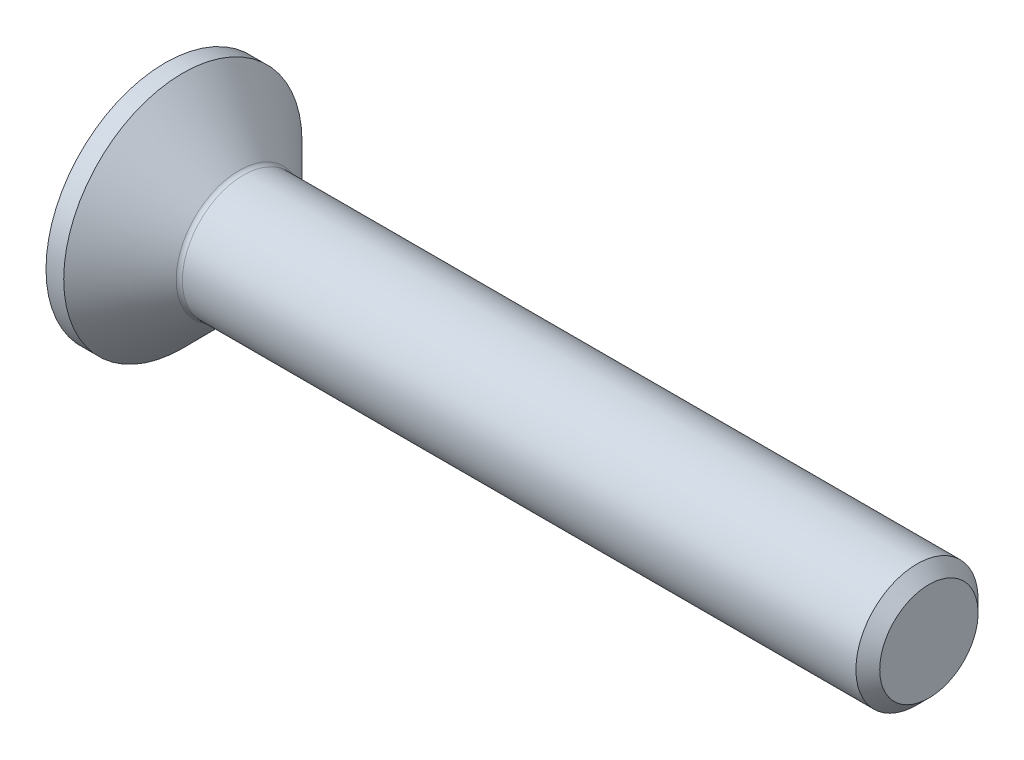
ISO-10303-21;
HEADER;
FILE_DESCRIPTION(('STEP AP214'),'2;1');
FILE_NAME('part.step','',(''),(''),'','','');
FILE_SCHEMA(('AUTOMOTIVE_DESIGN { 1 0 10303 214 1 1 1 1 }'));
ENDSEC;
DATA;
#1=APPLICATION_CONTEXT('core data for automotive mechanical design processes');
#2=APPLICATION_PROTOCOL_DEFINITION('international standard','automotive_design',2000,#1);
#3=PRODUCT_CONTEXT('',#1,'mechanical');
#4=PRODUCT('Part','Part','',(#3));
#5=PRODUCT_RELATED_PRODUCT_CATEGORY('part','',(#4));
#6=PRODUCT_DEFINITION_FORMATION('','',#4);
#7=PRODUCT_DEFINITION_CONTEXT('part definition',#1,'design');
#8=PRODUCT_DEFINITION('design','',#6,#7);
#9=PRODUCT_DEFINITION_SHAPE('','',#8);
#10=(LENGTH_UNIT() NAMED_UNIT(*) SI_UNIT(.MILLI.,.METRE.));
#11=(NAMED_UNIT(*) PLANE_ANGLE_UNIT() SI_UNIT($,.RADIAN.));
#12=(NAMED_UNIT(*) SI_UNIT($,.STERADIAN.) SOLID_ANGLE_UNIT());
#13=UNCERTAINTY_MEASURE_WITH_UNIT(LENGTH_MEASURE(1.E-05),#10,'distance_accuracy_value','');
#14=(GEOMETRIC_REPRESENTATION_CONTEXT(3) GLOBAL_UNCERTAINTY_ASSIGNED_CONTEXT((#13)) GLOBAL_UNIT_ASSIGNED_CONTEXT((#10,
#11,#12)) REPRESENTATION_CONTEXT('',''));
#15=CARTESIAN_POINT('',(0.,0.,0.));
#16=DIRECTION('',(0.,0.,1.));
#17=DIRECTION('',(1.,0.,0.));
#18=AXIS2_PLACEMENT_3D('',#15,#16,#17);
#19=CARTESIAN_POINT('',(0.,0.,0.));
#20=DIRECTION('',(-1.,0.,0.));
#21=DIRECTION('',(0.,0.,1.));
#22=AXIS2_PLACEMENT_3D('',#19,#20,#21);
#23=PLANE('',#22);
#24=CARTESIAN_POINT('',(0.,0.,0.));
#25=DIRECTION('',(-1.,0.,0.));
#26=DIRECTION('',(0.,0.,1.));
#27=AXIS2_PLACEMENT_3D('',#24,#25,#26);
#28=CIRCLE('',#27,3.9);
#29=CARTESIAN_POINT('',(0.,0.,3.9));
#30=VERTEX_POINT('',#29);
#31=EDGE_CURVE('E198',#30,#30,#28,.T.);
#32=ORIENTED_EDGE('',*,*,#31,.T.);
#33=EDGE_LOOP('',(#32));
#34=FACE_BOUND('',#33,.T.);
#35=DIRECTION('',(0.,-0.5,-0.866025403784438));
#36=VECTOR('',#35,1.);
#37=CARTESIAN_POINT('',(0.,-0.721687836487032,1.25));
#38=LINE('',#37,#36);
#39=CARTESIAN_POINT('',(0.,-0.721687836487032,1.25));
#40=VERTEX_POINT('',#39);
#41=CARTESIAN_POINT('',(0.,-1.44337567297407,0.));
#42=VERTEX_POINT('',#41);
#43=EDGE_CURVE('E151',#40,#42,#38,.T.);
#44=ORIENTED_EDGE('',*,*,#43,.T.);
#45=DIRECTION('',(0.,0.5,-0.866025403784438));
#46=VECTOR('',#45,1.);
#47=CARTESIAN_POINT('',(0.,-1.44337567297407,0.));
#48=LINE('',#47,#46);
#49=CARTESIAN_POINT('',(0.,-0.721687836487032,-1.25));
#50=VERTEX_POINT('',#49);
#51=EDGE_CURVE('E63',#42,#50,#48,.T.);
#52=ORIENTED_EDGE('',*,*,#51,.T.);
#53=DIRECTION('',(0.,1.,0.));
#54=VECTOR('',#53,1.);
#55=CARTESIAN_POINT('',(0.,-0.721687836487032,-1.25));
#56=LINE('',#55,#54);
#57=CARTESIAN_POINT('',(0.,0.721687836487032,-1.25));
#58=VERTEX_POINT('',#57);
#59=EDGE_CURVE('E167',#50,#58,#56,.T.);
#60=ORIENTED_EDGE('',*,*,#59,.T.);
#61=DIRECTION('',(0.,0.5,0.866025403784438));
#62=VECTOR('',#61,1.);
#63=CARTESIAN_POINT('',(0.,0.721687836487032,-1.25));
#64=LINE('',#63,#62);
#65=CARTESIAN_POINT('',(0.,1.44337567297406,0.));
#66=VERTEX_POINT('',#65);
#67=EDGE_CURVE('E328',#58,#66,#64,.T.);
#68=ORIENTED_EDGE('',*,*,#67,.T.);
#69=DIRECTION('',(0.,-0.5,0.866025403784439));
#70=VECTOR('',#69,1.);
#71=CARTESIAN_POINT('',(0.,1.44337567297406,0.));
#72=LINE('',#71,#70);
#73=CARTESIAN_POINT('',(0.,0.721687836487032,1.25));
#74=VERTEX_POINT('',#73);
#75=EDGE_CURVE('E332',#66,#74,#72,.T.);
#76=ORIENTED_EDGE('',*,*,#75,.T.);
#77=DIRECTION('',(0.,-1.,0.));
#78=VECTOR('',#77,1.);
#79=CARTESIAN_POINT('',(0.,0.721687836487032,1.25));
#80=LINE('',#79,#78);
#81=EDGE_CURVE('E336',#74,#40,#80,.T.);
#82=ORIENTED_EDGE('',*,*,#81,.T.);
#83=EDGE_LOOP('',(#44,#52,#60,#68,#76,#82));
#84=FACE_BOUND('',#83,.T.);
#85=ADVANCED_FACE('F45',(#34,#84),#23,.T.);
#86=CARTESIAN_POINT('',(0.,0.,0.));
#87=DIRECTION('',(-1.,0.,0.));
#88=DIRECTION('',(0.,0.,1.));
#89=AXIS2_PLACEMENT_3D('',#86,#87,#88);
#90=CYLINDRICAL_SURFACE('',#89,3.9);
#91=CARTESIAN_POINT('',(0.580000000000009,0.,0.));
#92=DIRECTION('',(-1.,0.,0.));
#93=DIRECTION('',(0.,0.,1.));
#94=AXIS2_PLACEMENT_3D('',#91,#92,#93);
#95=CIRCLE('',#94,3.9);
#96=CARTESIAN_POINT('',(0.580000000000009,0.,3.9));
#97=VERTEX_POINT('',#96);
#98=EDGE_CURVE('E194',#97,#97,#95,.T.);
#99=ORIENTED_EDGE('',*,*,#98,.T.);
#100=EDGE_LOOP('',(#99));
#101=FACE_BOUND('',#100,.T.);
#102=ORIENTED_EDGE('',*,*,#31,.F.);
#103=EDGE_LOOP('',(#102));
#104=FACE_BOUND('',#103,.T.);
#105=ADVANCED_FACE('F222',(#101,#104),#90,.T.);
#106=CARTESIAN_POINT('',(0.580000000000009,0.,0.));
#107=DIRECTION('',(-1.,0.,0.));
#108=DIRECTION('',(0.,0.,1.));
#109=AXIS2_PLACEMENT_3D('',#106,#107,#108);
#110=CONICAL_SURFACE('',#109,3.9,0.78539816339745);
#111=CARTESIAN_POINT('',(2.42142135623732,0.,0.));
#112=DIRECTION('',(-1.,0.,0.));
#113=DIRECTION('',(0.,0.,1.));
#114=AXIS2_PLACEMENT_3D('',#111,#112,#113);
#115=CIRCLE('',#114,2.05857864376268);
#116=CARTESIAN_POINT('',(2.42142135623732,0.,2.05857864376268));
#117=VERTEX_POINT('',#116);
#118=EDGE_CURVE('E54',#117,#117,#115,.T.);
#119=ORIENTED_EDGE('',*,*,#118,.T.);
#120=EDGE_LOOP('',(#119));
#121=FACE_BOUND('',#120,.T.);
#122=ORIENTED_EDGE('',*,*,#98,.F.);
#123=EDGE_LOOP('',(#122));
#124=FACE_BOUND('',#123,.T.);
#125=ADVANCED_FACE('F206',(#121,#124),#110,.T.);
#126=CARTESIAN_POINT('',(0.,0.,0.));
#127=DIRECTION('',(-1.,0.,0.));
#128=DIRECTION('',(0.,0.,1.));
#129=AXIS2_PLACEMENT_3D('',#126,#127,#128);
#130=CYLINDRICAL_SURFACE('',#129,1.99999999999999);
#131=CARTESIAN_POINT('',(2.56284271247463,0.,0.));
#132=DIRECTION('',(-1.,0.,0.));
#133=DIRECTION('',(0.,0.,1.));
#134=AXIS2_PLACEMENT_3D('',#131,#132,#133);
#135=CIRCLE('',#134,1.99999999999999);
#136=CARTESIAN_POINT('',(2.56284271247463,0.,1.99999999999999));
#137=VERTEX_POINT('',#136);
#138=EDGE_CURVE('E11',#137,#137,#135,.F.);
#139=ORIENTED_EDGE('',*,*,#138,.T.);
#140=EDGE_LOOP('',(#139));
#141=FACE_BOUND('',#140,.T.);
#142=CARTESIAN_POINT('',(24.61,0.,0.));
#143=DIRECTION('',(-1.,0.,0.));
#144=DIRECTION('',(0.,0.,1.));
#145=AXIS2_PLACEMENT_3D('',#142,#143,#144);
#146=CIRCLE('',#145,1.99999999999997);
#147=CARTESIAN_POINT('',(24.61,0.,1.99999999999997));
#148=VERTEX_POINT('',#147);
#149=EDGE_CURVE('E190',#148,#148,#146,.T.);
#150=ORIENTED_EDGE('',*,*,#149,.T.);
#151=EDGE_LOOP('',(#150));
#152=FACE_BOUND('',#151,.T.);
#153=ADVANCED_FACE('F233',(#141,#152),#130,.T.);
#154=CARTESIAN_POINT('',(25.,0.,0.));
#155=DIRECTION('',(-1.,0.,0.));
#156=DIRECTION('',(0.,0.,1.));
#157=AXIS2_PLACEMENT_3D('',#154,#155,#156);
#158=CONICAL_SURFACE('',#157,1.61,0.785398163397393);
#159=ORIENTED_EDGE('',*,*,#149,.F.);
#160=EDGE_LOOP('',(#159));
#161=FACE_BOUND('',#160,.T.);
#162=CARTESIAN_POINT('',(25.,0.,0.));
#163=DIRECTION('',(-1.,0.,0.));
#164=DIRECTION('',(0.,0.,1.));
#165=AXIS2_PLACEMENT_3D('',#162,#163,#164);
#166=CIRCLE('',#165,1.61);
#167=CARTESIAN_POINT('',(25.,0.,1.61));
#168=VERTEX_POINT('',#167);
#169=EDGE_CURVE('E185',#168,#168,#166,.T.);
#170=ORIENTED_EDGE('',*,*,#169,.T.);
#171=EDGE_LOOP('',(#170));
#172=FACE_BOUND('',#171,.T.);
#173=ADVANCED_FACE('F217',(#161,#172),#158,.T.);
#174=CARTESIAN_POINT('',(25.,1.61,0.));
#175=DIRECTION('',(1.,0.,0.));
#176=DIRECTION('',(0.,0.,-1.));
#177=AXIS2_PLACEMENT_3D('',#174,#175,#176);
#178=PLANE('',#177);
#179=ORIENTED_EDGE('',*,*,#169,.F.);
#180=EDGE_LOOP('',(#179));
#181=FACE_BOUND('',#180,.T.);
#182=ADVANCED_FACE('F210',(#181),#178,.T.);
#183=CARTESIAN_POINT('',(2.56284271247463,0.,0.));
#184=DIRECTION('',(-1.,0.,0.));
#185=DIRECTION('',(0.,0.,1.));
#186=AXIS2_PLACEMENT_3D('',#183,#184,#185);
#187=TOROIDAL_SURFACE('',#186,2.19999999999999,0.2);
#188=ORIENTED_EDGE('',*,*,#138,.F.);
#189=EDGE_LOOP('',(#188));
#190=FACE_BOUND('',#189,.T.);
#191=ORIENTED_EDGE('',*,*,#118,.F.);
#192=EDGE_LOOP('',(#191));
#193=FACE_BOUND('',#192,.T.);
#194=ADVANCED_FACE('F47',(#190,#193),#187,.F.);
#195=CARTESIAN_POINT('',(1.5,-1.44337567297407,0.));
#196=DIRECTION('',(0.,0.866025403784438,0.5));
#197=DIRECTION('',(0.,-0.5,0.866025403784439));
#198=AXIS2_PLACEMENT_3D('',#195,#196,#197);
#199=PLANE('',#198);
#200=ORIENTED_EDGE('',*,*,#51,.F.);
#201=DIRECTION('',(-1.,0.,0.));
#202=VECTOR('',#201,1.);
#203=CARTESIAN_POINT('',(1.5,-1.44337567297407,0.));
#204=LINE('',#203,#202);
#205=CARTESIAN_POINT('',(1.5,-1.44337567297407,0.));
#206=VERTEX_POINT('',#205);
#207=EDGE_CURVE('E323',#206,#42,#204,.T.);
#208=ORIENTED_EDGE('',*,*,#207,.F.);
#209=DIRECTION('',(0.,0.5,-0.866025403784438));
#210=VECTOR('',#209,1.);
#211=CARTESIAN_POINT('',(1.5,-1.44337567297407,0.));
#212=LINE('',#211,#210);
#213=CARTESIAN_POINT('',(1.5,-1.08253175473055,-0.625000000000001));
#214=VERTEX_POINT('',#213);
#215=EDGE_CURVE('E147',#206,#214,#212,.T.);
#216=ORIENTED_EDGE('',*,*,#215,.T.);
#217=CARTESIAN_POINT('',(1.5,-0.721687836487032,-1.25));
#218=VERTEX_POINT('',#217);
#219=EDGE_CURVE('E141',#214,#218,#212,.T.);
#220=ORIENTED_EDGE('',*,*,#219,.T.);
#221=DIRECTION('',(-1.,0.,0.));
#222=VECTOR('',#221,1.);
#223=CARTESIAN_POINT('',(1.5,-0.721687836487032,-1.25));
#224=LINE('',#223,#222);
#225=EDGE_CURVE('E145',#218,#50,#224,.T.);
#226=ORIENTED_EDGE('',*,*,#225,.T.);
#227=EDGE_LOOP('',(#200,#208,#216,#220,#226));
#228=FACE_BOUND('',#227,.T.);
#229=ADVANCED_FACE('F143',(#228),#199,.T.);
#230=CARTESIAN_POINT('',(1.5,-0.721687836487032,-1.25));
#231=DIRECTION('',(0.,0.,1.));
#232=DIRECTION('',(0.,-1.,0.));
#233=AXIS2_PLACEMENT_3D('',#230,#231,#232);
#234=PLANE('',#233);
#235=ORIENTED_EDGE('',*,*,#59,.F.);
#236=ORIENTED_EDGE('',*,*,#225,.F.);
#237=DIRECTION('',(0.,1.,0.));
#238=VECTOR('',#237,1.);
#239=CARTESIAN_POINT('',(1.5,-0.721687836487032,-1.25));
#240=LINE('',#239,#238);
#241=CARTESIAN_POINT('',(1.5,0.,-1.25));
#242=VERTEX_POINT('',#241);
#243=EDGE_CURVE('E154',#218,#242,#240,.T.);
#244=ORIENTED_EDGE('',*,*,#243,.T.);
#245=CARTESIAN_POINT('',(1.5,0.721687836487032,-1.25));
#246=VERTEX_POINT('',#245);
#247=EDGE_CURVE('E162',#242,#246,#240,.T.);
#248=ORIENTED_EDGE('',*,*,#247,.T.);
#249=DIRECTION('',(-1.,0.,0.));
#250=VECTOR('',#249,1.);
#251=CARTESIAN_POINT('',(1.5,0.721687836487032,-1.25));
#252=LINE('',#251,#250);
#253=EDGE_CURVE('E170',#246,#58,#252,.T.);
#254=ORIENTED_EDGE('',*,*,#253,.T.);
#255=EDGE_LOOP('',(#235,#236,#244,#248,#254));
#256=FACE_BOUND('',#255,.T.);
#257=ADVANCED_FACE('F164',(#256),#234,.T.);
#258=CARTESIAN_POINT('',(1.5,0.721687836487032,-1.25));
#259=DIRECTION('',(0.,-0.866025403784439,0.5));
#260=DIRECTION('',(0.,-0.5,-0.866025403784439));
#261=AXIS2_PLACEMENT_3D('',#258,#259,#260);
#262=PLANE('',#261);
#263=ORIENTED_EDGE('',*,*,#67,.F.);
#264=ORIENTED_EDGE('',*,*,#253,.F.);
#265=DIRECTION('',(0.,0.5,0.866025403784438));
#266=VECTOR('',#265,1.);
#267=CARTESIAN_POINT('',(1.5,0.721687836487032,-1.25));
#268=LINE('',#267,#266);
#269=CARTESIAN_POINT('',(1.5,1.08253175473055,-0.625));
#270=VERTEX_POINT('',#269);
#271=EDGE_CURVE('E311',#246,#270,#268,.T.);
#272=ORIENTED_EDGE('',*,*,#271,.T.);
#273=CARTESIAN_POINT('',(1.5,1.44337567297406,0.));
#274=VERTEX_POINT('',#273);
#275=EDGE_CURVE('E161',#270,#274,#268,.T.);
#276=ORIENTED_EDGE('',*,*,#275,.T.);
#277=DIRECTION('',(-1.,0.,0.));
#278=VECTOR('',#277,1.);
#279=CARTESIAN_POINT('',(1.5,1.44337567297406,0.));
#280=LINE('',#279,#278);
#281=EDGE_CURVE('E179',#274,#66,#280,.T.);
#282=ORIENTED_EDGE('',*,*,#281,.T.);
#283=EDGE_LOOP('',(#263,#264,#272,#276,#282));
#284=FACE_BOUND('',#283,.T.);
#285=ADVANCED_FACE('F247',(#284),#262,.T.);
#286=CARTESIAN_POINT('',(1.5,1.44337567297406,0.));
#287=DIRECTION('',(0.,-0.866025403784438,-0.5));
#288=DIRECTION('',(0.,0.5,-0.866025403784439));
#289=AXIS2_PLACEMENT_3D('',#286,#287,#288);
#290=PLANE('',#289);
#291=ORIENTED_EDGE('',*,*,#75,.F.);
#292=ORIENTED_EDGE('',*,*,#281,.F.);
#293=DIRECTION('',(0.,-0.5,0.866025403784439));
#294=VECTOR('',#293,1.);
#295=CARTESIAN_POINT('',(1.5,1.44337567297406,0.));
#296=LINE('',#295,#294);
#297=CARTESIAN_POINT('',(1.5,1.08253175473055,0.625));
#298=VERTEX_POINT('',#297);
#299=EDGE_CURVE('E74',#274,#298,#296,.T.);
#300=ORIENTED_EDGE('',*,*,#299,.T.);
#301=CARTESIAN_POINT('',(1.5,0.721687836487032,1.25));
#302=VERTEX_POINT('',#301);
#303=EDGE_CURVE('E282',#298,#302,#296,.T.);
#304=ORIENTED_EDGE('',*,*,#303,.T.);
#305=DIRECTION('',(-1.,0.,0.));
#306=VECTOR('',#305,1.);
#307=CARTESIAN_POINT('',(1.5,0.721687836487032,1.25));
#308=LINE('',#307,#306);
#309=EDGE_CURVE('E297',#302,#74,#308,.T.);
#310=ORIENTED_EDGE('',*,*,#309,.T.);
#311=EDGE_LOOP('',(#291,#292,#300,#304,#310));
#312=FACE_BOUND('',#311,.T.);
#313=ADVANCED_FACE('F250',(#312),#290,.T.);
#314=CARTESIAN_POINT('',(1.5,0.721687836487032,1.25));
#315=DIRECTION('',(0.,0.,-1.));
#316=DIRECTION('',(-1.,0.,0.));
#317=AXIS2_PLACEMENT_3D('',#314,#315,#316);
#318=PLANE('',#317);
#319=ORIENTED_EDGE('',*,*,#81,.F.);
#320=ORIENTED_EDGE('',*,*,#309,.F.);
#321=DIRECTION('',(0.,-1.,0.));
#322=VECTOR('',#321,1.);
#323=CARTESIAN_POINT('',(1.5,0.721687836487032,1.25));
#324=LINE('',#323,#322);
#325=CARTESIAN_POINT('',(1.5,0.,1.25));
#326=VERTEX_POINT('',#325);
#327=EDGE_CURVE('E281',#302,#326,#324,.T.);
#328=ORIENTED_EDGE('',*,*,#327,.T.);
#329=CARTESIAN_POINT('',(1.5,-0.721687836487032,1.25));
#330=VERTEX_POINT('',#329);
#331=EDGE_CURVE('E287',#326,#330,#324,.T.);
#332=ORIENTED_EDGE('',*,*,#331,.T.);
#333=DIRECTION('',(-1.,0.,0.));
#334=VECTOR('',#333,1.);
#335=CARTESIAN_POINT('',(1.5,-0.721687836487032,1.25));
#336=LINE('',#335,#334);
#337=EDGE_CURVE('E345',#330,#40,#336,.T.);
#338=ORIENTED_EDGE('',*,*,#337,.T.);
#339=EDGE_LOOP('',(#319,#320,#328,#332,#338));
#340=FACE_BOUND('',#339,.T.);
#341=ADVANCED_FACE('F254',(#340),#318,.T.);
#342=CARTESIAN_POINT('',(1.5,-0.721687836487032,1.25));
#343=DIRECTION('',(0.,0.866025403784438,-0.5));
#344=DIRECTION('',(0.,0.5,0.866025403784439));
#345=AXIS2_PLACEMENT_3D('',#342,#343,#344);
#346=PLANE('',#345);
#347=ORIENTED_EDGE('',*,*,#43,.F.);
#348=ORIENTED_EDGE('',*,*,#337,.F.);
#349=DIRECTION('',(0.,-0.5,-0.866025403784438));
#350=VECTOR('',#349,1.);
#351=CARTESIAN_POINT('',(1.5,-0.721687836487032,1.25));
#352=LINE('',#351,#350);
#353=CARTESIAN_POINT('',(1.5,-1.08253175473055,0.625000000000001));
#354=VERTEX_POINT('',#353);
#355=EDGE_CURVE('E290',#330,#354,#352,.T.);
#356=ORIENTED_EDGE('',*,*,#355,.T.);
#357=EDGE_CURVE('E299',#354,#206,#352,.T.);
#358=ORIENTED_EDGE('',*,*,#357,.T.);
#359=ORIENTED_EDGE('',*,*,#207,.T.);
#360=EDGE_LOOP('',(#347,#348,#356,#358,#359));
#361=FACE_BOUND('',#360,.T.);
#362=ADVANCED_FACE('F257',(#361),#346,.T.);
#363=CARTESIAN_POINT('',(1.5,-1.44337567297407,0.));
#364=DIRECTION('',(-1.,0.,0.));
#365=DIRECTION('',(0.,0.,1.));
#366=AXIS2_PLACEMENT_3D('',#363,#364,#365);
#367=PLANE('',#366);
#368=CARTESIAN_POINT('',(1.5,0.,0.));
#369=DIRECTION('',(-1.,0.,0.));
#370=DIRECTION('',(0.,0.,1.));
#371=AXIS2_PLACEMENT_3D('',#368,#369,#370);
#372=CIRCLE('',#371,1.25);
#373=EDGE_CURVE('E169',#354,#326,#372,.T.);
#374=ORIENTED_EDGE('',*,*,#373,.F.);
#375=ORIENTED_EDGE('',*,*,#355,.F.);
#376=ORIENTED_EDGE('',*,*,#331,.F.);
#377=EDGE_LOOP('',(#374,#375,#376));
#378=FACE_BOUND('',#377,.T.);
#379=ADVANCED_FACE('F261',(#378),#367,.T.);
#380=EDGE_CURVE('E175',#214,#354,#372,.T.);
#381=ORIENTED_EDGE('',*,*,#380,.F.);
#382=ORIENTED_EDGE('',*,*,#215,.F.);
#383=ORIENTED_EDGE('',*,*,#357,.F.);
#384=EDGE_LOOP('',(#381,#382,#383));
#385=FACE_BOUND('',#384,.T.);
#386=ADVANCED_FACE('F264',(#385),#367,.T.);
#387=EDGE_CURVE('E156',#242,#214,#372,.T.);
#388=ORIENTED_EDGE('',*,*,#387,.F.);
#389=ORIENTED_EDGE('',*,*,#243,.F.);
#390=ORIENTED_EDGE('',*,*,#219,.F.);
#391=EDGE_LOOP('',(#388,#389,#390));
#392=FACE_BOUND('',#391,.T.);
#393=ADVANCED_FACE('F155',(#392),#367,.T.);
#394=EDGE_CURVE('E305',#270,#242,#372,.T.);
#395=ORIENTED_EDGE('',*,*,#394,.F.);
#396=ORIENTED_EDGE('',*,*,#271,.F.);
#397=ORIENTED_EDGE('',*,*,#247,.F.);
#398=EDGE_LOOP('',(#395,#396,#397));
#399=FACE_BOUND('',#398,.T.);
#400=ADVANCED_FACE('F276',(#399),#367,.T.);
#401=EDGE_CURVE('E186',#298,#270,#372,.T.);
#402=ORIENTED_EDGE('',*,*,#401,.F.);
#403=ORIENTED_EDGE('',*,*,#299,.F.);
#404=ORIENTED_EDGE('',*,*,#275,.F.);
#405=EDGE_LOOP('',(#402,#403,#404));
#406=FACE_BOUND('',#405,.T.);
#407=ADVANCED_FACE('F271',(#406),#367,.T.);
#408=EDGE_CURVE('E177',#326,#298,#372,.T.);
#409=ORIENTED_EDGE('',*,*,#408,.F.);
#410=ORIENTED_EDGE('',*,*,#327,.F.);
#411=ORIENTED_EDGE('',*,*,#303,.F.);
#412=EDGE_LOOP('',(#409,#410,#411));
#413=FACE_BOUND('',#412,.T.);
#414=ADVANCED_FACE('F242',(#413),#367,.T.);
#415=CARTESIAN_POINT('',(1.5,0.,0.));
#416=DIRECTION('',(-1.,0.,0.));
#417=DIRECTION('',(0.,0.,1.));
#418=AXIS2_PLACEMENT_3D('',#415,#416,#417);
#419=CONICAL_SURFACE('',#418,1.25,1.04719755119659);
#420=CARTESIAN_POINT('',(2.22168783648704,0.,0.));
#421=VERTEX_POINT('',#420);
#422=VERTEX_LOOP('',#421);
#423=FACE_BOUND('',#422,.T.);
#424=ORIENTED_EDGE('',*,*,#408,.T.);
#425=ORIENTED_EDGE('',*,*,#401,.T.);
#426=ORIENTED_EDGE('',*,*,#394,.T.);
#427=ORIENTED_EDGE('',*,*,#387,.T.);
#428=ORIENTED_EDGE('',*,*,#380,.T.);
#429=ORIENTED_EDGE('',*,*,#373,.T.);
#430=EDGE_LOOP('',(#424,#425,#426,#427,#428,#429));
#431=FACE_BOUND('',#430,.T.);
#432=ADVANCED_FACE('F240',(#423,#431),#419,.F.);
#433=CLOSED_SHELL('',(#85,#105,#125,#153,#173,#182,#194,#229,#257,#285,#313,#341,#362,#379,#386,
#393,#400,#407,#414,#432));
#434=MANIFOLD_SOLID_BREP('B2',#433);
#435=ADVANCED_BREP_SHAPE_REPRESENTATION('',(#18,#434),#14);
#436=SHAPE_DEFINITION_REPRESENTATION(#9,#435);
ENDSEC;
END-ISO-10303-21;
